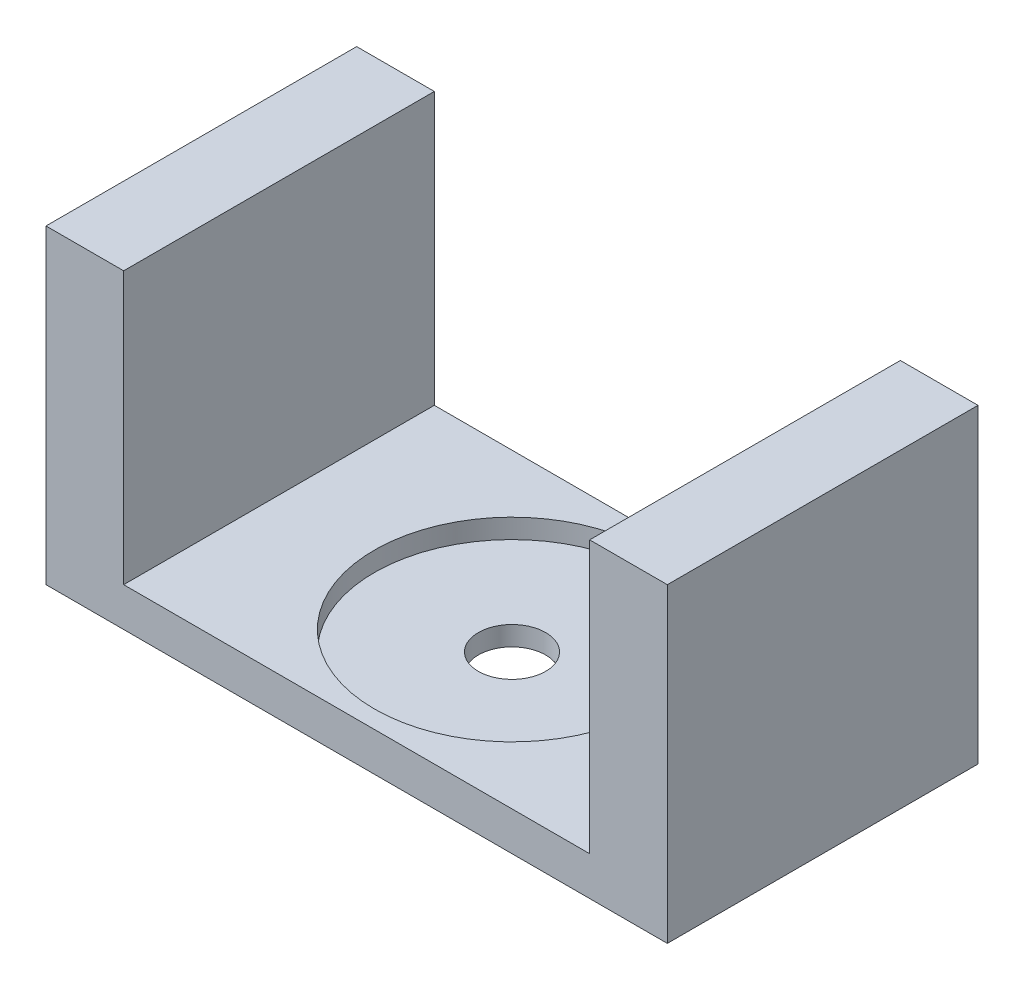
ISO-10303-21;
HEADER;
FILE_DESCRIPTION(('STEP AP214'),'2;1');
FILE_NAME('part.step','',(''),(''),'','','');
FILE_SCHEMA(('AUTOMOTIVE_DESIGN { 1 0 10303 214 1 1 1 1 }'));
ENDSEC;
DATA;
#1=APPLICATION_CONTEXT('core data for automotive mechanical design processes');
#2=APPLICATION_PROTOCOL_DEFINITION('international standard','automotive_design',2000,#1);
#3=PRODUCT_CONTEXT('',#1,'mechanical');
#4=PRODUCT('Part','Part','',(#3));
#5=PRODUCT_RELATED_PRODUCT_CATEGORY('part','',(#4));
#6=PRODUCT_DEFINITION_FORMATION('','',#4);
#7=PRODUCT_DEFINITION_CONTEXT('part definition',#1,'design');
#8=PRODUCT_DEFINITION('design','',#6,#7);
#9=PRODUCT_DEFINITION_SHAPE('','',#8);
#10=(LENGTH_UNIT() NAMED_UNIT(*) SI_UNIT(.MILLI.,.METRE.));
#11=(NAMED_UNIT(*) PLANE_ANGLE_UNIT() SI_UNIT($,.RADIAN.));
#12=(NAMED_UNIT(*) SI_UNIT($,.STERADIAN.) SOLID_ANGLE_UNIT());
#13=UNCERTAINTY_MEASURE_WITH_UNIT(LENGTH_MEASURE(1.E-05),#10,'distance_accuracy_value','');
#14=(GEOMETRIC_REPRESENTATION_CONTEXT(3) GLOBAL_UNCERTAINTY_ASSIGNED_CONTEXT((#13)) GLOBAL_UNIT_ASSIGNED_CONTEXT((#10,
#11,#12)) REPRESENTATION_CONTEXT('',''));
#15=CARTESIAN_POINT('',(0.,0.,0.));
#16=DIRECTION('',(0.,0.,1.));
#17=DIRECTION('',(1.,0.,0.));
#18=AXIS2_PLACEMENT_3D('',#15,#16,#17);
#19=CARTESIAN_POINT('',(-38.1,6.34999999999997,50.8));
#20=DIRECTION('',(-1.,0.,0.));
#21=DIRECTION('',(0.,0.,1.));
#22=AXIS2_PLACEMENT_3D('',#19,#20,#21);
#23=PLANE('',#22);
#24=DIRECTION('',(0.,1.,0.));
#25=VECTOR('',#24,1.);
#26=CARTESIAN_POINT('',(-38.1,6.34999999999997,0.));
#27=LINE('',#26,#25);
#28=CARTESIAN_POINT('',(-38.1,6.34999999999997,0.));
#29=VERTEX_POINT('',#28);
#30=CARTESIAN_POINT('',(-38.1,50.8,0.));
#31=VERTEX_POINT('',#30);
#32=EDGE_CURVE('E128',#29,#31,#27,.T.);
#33=ORIENTED_EDGE('',*,*,#32,.T.);
#34=DIRECTION('',(0.,0.,-1.));
#35=VECTOR('',#34,1.);
#36=CARTESIAN_POINT('',(-38.1,50.8,50.8));
#37=LINE('',#36,#35);
#38=CARTESIAN_POINT('',(-38.1,50.8,50.8));
#39=VERTEX_POINT('',#38);
#40=EDGE_CURVE('E11',#39,#31,#37,.T.);
#41=ORIENTED_EDGE('',*,*,#40,.F.);
#42=DIRECTION('',(0.,1.,0.));
#43=VECTOR('',#42,1.);
#44=CARTESIAN_POINT('',(-38.1,6.34999999999997,50.8));
#45=LINE('',#44,#43);
#46=CARTESIAN_POINT('',(-38.1,6.34999999999997,50.8));
#47=VERTEX_POINT('',#46);
#48=EDGE_CURVE('E143',#47,#39,#45,.T.);
#49=ORIENTED_EDGE('',*,*,#48,.F.);
#50=DIRECTION('',(0.,0.,-1.));
#51=VECTOR('',#50,1.);
#52=CARTESIAN_POINT('',(-38.1,6.34999999999997,50.8));
#53=LINE('',#52,#51);
#54=EDGE_CURVE('E124',#47,#29,#53,.T.);
#55=ORIENTED_EDGE('',*,*,#54,.T.);
#56=EDGE_LOOP('',(#33,#41,#49,#55));
#57=FACE_BOUND('',#56,.T.);
#58=ADVANCED_FACE('F32',(#57),#23,.F.);
#59=CARTESIAN_POINT('',(-38.1,50.8,50.8));
#60=DIRECTION('',(0.,-1.,0.));
#61=DIRECTION('',(1.,0.,0.));
#62=AXIS2_PLACEMENT_3D('',#59,#60,#61);
#63=PLANE('',#62);
#64=DIRECTION('',(-1.,0.,0.));
#65=VECTOR('',#64,1.);
#66=CARTESIAN_POINT('',(-38.1,50.8,0.));
#67=LINE('',#66,#65);
#68=CARTESIAN_POINT('',(-50.8,50.8,0.));
#69=VERTEX_POINT('',#68);
#70=EDGE_CURVE('E131',#31,#69,#67,.T.);
#71=ORIENTED_EDGE('',*,*,#70,.T.);
#72=DIRECTION('',(0.,0.,-1.));
#73=VECTOR('',#72,1.);
#74=CARTESIAN_POINT('',(-50.8,50.8,50.8));
#75=LINE('',#74,#73);
#76=CARTESIAN_POINT('',(-50.8,50.8,50.8));
#77=VERTEX_POINT('',#76);
#78=EDGE_CURVE('E40',#77,#69,#75,.T.);
#79=ORIENTED_EDGE('',*,*,#78,.F.);
#80=DIRECTION('',(-1.,0.,0.));
#81=VECTOR('',#80,1.);
#82=CARTESIAN_POINT('',(-38.1,50.8,50.8));
#83=LINE('',#82,#81);
#84=EDGE_CURVE('E91',#39,#77,#83,.T.);
#85=ORIENTED_EDGE('',*,*,#84,.F.);
#86=ORIENTED_EDGE('',*,*,#40,.T.);
#87=EDGE_LOOP('',(#71,#79,#85,#86));
#88=FACE_BOUND('',#87,.T.);
#89=ADVANCED_FACE('F218',(#88),#63,.F.);
#90=CARTESIAN_POINT('',(-50.8,0.,50.8));
#91=DIRECTION('',(1.,0.,0.));
#92=DIRECTION('',(0.,0.,-1.));
#93=AXIS2_PLACEMENT_3D('',#90,#91,#92);
#94=PLANE('',#93);
#95=DIRECTION('',(0.,-1.,0.));
#96=VECTOR('',#95,1.);
#97=CARTESIAN_POINT('',(-50.8,0.,0.));
#98=LINE('',#97,#96);
#99=CARTESIAN_POINT('',(-50.8,0.,0.));
#100=VERTEX_POINT('',#99);
#101=EDGE_CURVE('E134',#69,#100,#98,.T.);
#102=ORIENTED_EDGE('',*,*,#101,.T.);
#103=DIRECTION('',(0.,0.,-1.));
#104=VECTOR('',#103,1.);
#105=CARTESIAN_POINT('',(-50.8,0.,50.8));
#106=LINE('',#105,#104);
#107=CARTESIAN_POINT('',(-50.8,0.,50.8));
#108=VERTEX_POINT('',#107);
#109=EDGE_CURVE('E150',#108,#100,#106,.T.);
#110=ORIENTED_EDGE('',*,*,#109,.F.);
#111=DIRECTION('',(0.,-1.,0.));
#112=VECTOR('',#111,1.);
#113=CARTESIAN_POINT('',(-50.8,0.,50.8));
#114=LINE('',#113,#112);
#115=EDGE_CURVE('E158',#77,#108,#114,.T.);
#116=ORIENTED_EDGE('',*,*,#115,.F.);
#117=ORIENTED_EDGE('',*,*,#78,.T.);
#118=EDGE_LOOP('',(#102,#110,#116,#117));
#119=FACE_BOUND('',#118,.T.);
#120=ADVANCED_FACE('F156',(#119),#94,.F.);
#121=CARTESIAN_POINT('',(50.8,0.,50.8));
#122=DIRECTION('',(0.,1.,0.));
#123=DIRECTION('',(0.,0.,1.));
#124=AXIS2_PLACEMENT_3D('',#121,#122,#123);
#125=PLANE('',#124);
#126=CARTESIAN_POINT('',(0.,0.,25.4));
#127=DIRECTION('',(0.,1.,0.));
#128=DIRECTION('',(0.,0.,1.));
#129=AXIS2_PLACEMENT_3D('',#126,#127,#128);
#130=CIRCLE('',#129,5.5);
#131=CARTESIAN_POINT('',(0.,0.,30.9));
#132=VERTEX_POINT('',#131);
#133=EDGE_CURVE('E179',#132,#132,#130,.T.);
#134=ORIENTED_EDGE('',*,*,#133,.T.);
#135=EDGE_LOOP('',(#134));
#136=FACE_BOUND('',#135,.T.);
#137=DIRECTION('',(1.,0.,0.));
#138=VECTOR('',#137,1.);
#139=CARTESIAN_POINT('',(50.8,0.,0.));
#140=LINE('',#139,#138);
#141=CARTESIAN_POINT('',(50.8,0.,0.));
#142=VERTEX_POINT('',#141);
#143=EDGE_CURVE('E136',#100,#142,#140,.T.);
#144=ORIENTED_EDGE('',*,*,#143,.T.);
#145=DIRECTION('',(0.,0.,-1.));
#146=VECTOR('',#145,1.);
#147=CARTESIAN_POINT('',(50.8,0.,50.8));
#148=LINE('',#147,#146);
#149=CARTESIAN_POINT('',(50.8,0.,50.8));
#150=VERTEX_POINT('',#149);
#151=EDGE_CURVE('E147',#150,#142,#148,.T.);
#152=ORIENTED_EDGE('',*,*,#151,.F.);
#153=DIRECTION('',(1.,0.,0.));
#154=VECTOR('',#153,1.);
#155=CARTESIAN_POINT('',(50.8,0.,50.8));
#156=LINE('',#155,#154);
#157=EDGE_CURVE('E170',#108,#150,#156,.T.);
#158=ORIENTED_EDGE('',*,*,#157,.F.);
#159=ORIENTED_EDGE('',*,*,#109,.T.);
#160=EDGE_LOOP('',(#144,#152,#158,#159));
#161=FACE_BOUND('',#160,.T.);
#162=ADVANCED_FACE('F166',(#136,#161),#125,.F.);
#163=CARTESIAN_POINT('',(50.8,0.,50.8));
#164=DIRECTION('',(-1.,0.,0.));
#165=DIRECTION('',(0.,0.,1.));
#166=AXIS2_PLACEMENT_3D('',#163,#164,#165);
#167=PLANE('',#166);
#168=DIRECTION('',(0.,1.,0.));
#169=VECTOR('',#168,1.);
#170=CARTESIAN_POINT('',(50.8,0.,0.));
#171=LINE('',#170,#169);
#172=CARTESIAN_POINT('',(50.8,50.8,0.));
#173=VERTEX_POINT('',#172);
#174=EDGE_CURVE('E138',#142,#173,#171,.T.);
#175=ORIENTED_EDGE('',*,*,#174,.T.);
#176=DIRECTION('',(0.,0.,-1.));
#177=VECTOR('',#176,1.);
#178=CARTESIAN_POINT('',(50.8,50.8,50.8));
#179=LINE('',#178,#177);
#180=CARTESIAN_POINT('',(50.8,50.8,50.8));
#181=VERTEX_POINT('',#180);
#182=EDGE_CURVE('E119',#181,#173,#179,.T.);
#183=ORIENTED_EDGE('',*,*,#182,.F.);
#184=DIRECTION('',(0.,1.,0.));
#185=VECTOR('',#184,1.);
#186=CARTESIAN_POINT('',(50.8,0.,50.8));
#187=LINE('',#186,#185);
#188=EDGE_CURVE('E110',#150,#181,#187,.T.);
#189=ORIENTED_EDGE('',*,*,#188,.F.);
#190=ORIENTED_EDGE('',*,*,#151,.T.);
#191=EDGE_LOOP('',(#175,#183,#189,#190));
#192=FACE_BOUND('',#191,.T.);
#193=ADVANCED_FACE('F169',(#192),#167,.F.);
#194=CARTESIAN_POINT('',(38.1,50.8,50.8));
#195=DIRECTION('',(0.,-1.,0.));
#196=DIRECTION('',(1.,0.,0.));
#197=AXIS2_PLACEMENT_3D('',#194,#195,#196);
#198=PLANE('',#197);
#199=DIRECTION('',(-1.,0.,0.));
#200=VECTOR('',#199,1.);
#201=CARTESIAN_POINT('',(38.1,50.8,0.));
#202=LINE('',#201,#200);
#203=CARTESIAN_POINT('',(38.1,50.8,0.));
#204=VERTEX_POINT('',#203);
#205=EDGE_CURVE('E118',#173,#204,#202,.T.);
#206=ORIENTED_EDGE('',*,*,#205,.T.);
#207=DIRECTION('',(0.,0.,-1.));
#208=VECTOR('',#207,1.);
#209=CARTESIAN_POINT('',(38.1,50.8,50.8));
#210=LINE('',#209,#208);
#211=CARTESIAN_POINT('',(38.1,50.8,50.8));
#212=VERTEX_POINT('',#211);
#213=EDGE_CURVE('E115',#212,#204,#210,.T.);
#214=ORIENTED_EDGE('',*,*,#213,.F.);
#215=DIRECTION('',(-1.,0.,0.));
#216=VECTOR('',#215,1.);
#217=CARTESIAN_POINT('',(38.1,50.8,50.8));
#218=LINE('',#217,#216);
#219=EDGE_CURVE('E104',#181,#212,#218,.T.);
#220=ORIENTED_EDGE('',*,*,#219,.F.);
#221=ORIENTED_EDGE('',*,*,#182,.T.);
#222=EDGE_LOOP('',(#206,#214,#220,#221));
#223=FACE_BOUND('',#222,.T.);
#224=ADVANCED_FACE('F116',(#223),#198,.F.);
#225=CARTESIAN_POINT('',(38.1,6.34999999999997,50.8));
#226=DIRECTION('',(1.,0.,0.));
#227=DIRECTION('',(0.,0.,-1.));
#228=AXIS2_PLACEMENT_3D('',#225,#226,#227);
#229=PLANE('',#228);
#230=DIRECTION('',(0.,-1.,0.));
#231=VECTOR('',#230,1.);
#232=CARTESIAN_POINT('',(38.1,6.34999999999997,0.));
#233=LINE('',#232,#231);
#234=CARTESIAN_POINT('',(38.1,6.34999999999997,0.));
#235=VERTEX_POINT('',#234);
#236=EDGE_CURVE('E77',#204,#235,#233,.T.);
#237=ORIENTED_EDGE('',*,*,#236,.T.);
#238=DIRECTION('',(0.,0.,-1.));
#239=VECTOR('',#238,1.);
#240=CARTESIAN_POINT('',(38.1,6.34999999999997,50.8));
#241=LINE('',#240,#239);
#242=CARTESIAN_POINT('',(38.1,6.34999999999997,50.8));
#243=VERTEX_POINT('',#242);
#244=EDGE_CURVE('E120',#243,#235,#241,.T.);
#245=ORIENTED_EDGE('',*,*,#244,.F.);
#246=DIRECTION('',(0.,-1.,0.));
#247=VECTOR('',#246,1.);
#248=CARTESIAN_POINT('',(38.1,6.34999999999997,50.8));
#249=LINE('',#248,#247);
#250=EDGE_CURVE('E108',#212,#243,#249,.T.);
#251=ORIENTED_EDGE('',*,*,#250,.F.);
#252=ORIENTED_EDGE('',*,*,#213,.T.);
#253=EDGE_LOOP('',(#237,#245,#251,#252));
#254=FACE_BOUND('',#253,.T.);
#255=ADVANCED_FACE('F122',(#254),#229,.F.);
#256=CARTESIAN_POINT('',(38.1,6.34999999999997,50.8));
#257=DIRECTION('',(0.,-1.,0.));
#258=DIRECTION('',(0.,0.,-1.));
#259=AXIS2_PLACEMENT_3D('',#256,#257,#258);
#260=PLANE('',#259);
#261=CARTESIAN_POINT('',(0.,6.34999999999997,25.4));
#262=DIRECTION('',(0.,1.,0.));
#263=DIRECTION('',(0.,0.,1.));
#264=AXIS2_PLACEMENT_3D('',#261,#262,#263);
#265=CIRCLE('',#264,22.5044);
#266=CARTESIAN_POINT('',(0.,6.34999999999997,47.9044));
#267=VERTEX_POINT('',#266);
#268=EDGE_CURVE('E176',#267,#267,#265,.T.);
#269=ORIENTED_EDGE('',*,*,#268,.F.);
#270=EDGE_LOOP('',(#269));
#271=FACE_BOUND('',#270,.T.);
#272=DIRECTION('',(-1.,0.,0.));
#273=VECTOR('',#272,1.);
#274=CARTESIAN_POINT('',(38.1,6.34999999999997,0.));
#275=LINE('',#274,#273);
#276=EDGE_CURVE('E83',#235,#29,#275,.T.);
#277=ORIENTED_EDGE('',*,*,#276,.T.);
#278=ORIENTED_EDGE('',*,*,#54,.F.);
#279=DIRECTION('',(-1.,0.,0.));
#280=VECTOR('',#279,1.);
#281=CARTESIAN_POINT('',(38.1,6.34999999999997,50.8));
#282=LINE('',#281,#280);
#283=EDGE_CURVE('E48',#243,#47,#282,.T.);
#284=ORIENTED_EDGE('',*,*,#283,.F.);
#285=ORIENTED_EDGE('',*,*,#244,.T.);
#286=EDGE_LOOP('',(#277,#278,#284,#285));
#287=FACE_BOUND('',#286,.T.);
#288=ADVANCED_FACE('F207',(#271,#287),#260,.F.);
#289=CARTESIAN_POINT('',(0.,0.,50.8));
#290=DIRECTION('',(0.,0.,1.));
#291=DIRECTION('',(1.,0.,0.));
#292=AXIS2_PLACEMENT_3D('',#289,#290,#291);
#293=PLANE('',#292);
#294=ORIENTED_EDGE('',*,*,#48,.T.);
#295=ORIENTED_EDGE('',*,*,#84,.T.);
#296=ORIENTED_EDGE('',*,*,#115,.T.);
#297=ORIENTED_EDGE('',*,*,#157,.T.);
#298=ORIENTED_EDGE('',*,*,#188,.T.);
#299=ORIENTED_EDGE('',*,*,#219,.T.);
#300=ORIENTED_EDGE('',*,*,#250,.T.);
#301=ORIENTED_EDGE('',*,*,#283,.T.);
#302=EDGE_LOOP('',(#294,#295,#296,#297,#298,#299,#300,#301));
#303=FACE_BOUND('',#302,.T.);
#304=ADVANCED_FACE('F106',(#303),#293,.T.);
#305=CARTESIAN_POINT('',(0.,0.,0.));
#306=DIRECTION('',(0.,0.,1.));
#307=DIRECTION('',(1.,0.,0.));
#308=AXIS2_PLACEMENT_3D('',#305,#306,#307);
#309=PLANE('',#308);
#310=ORIENTED_EDGE('',*,*,#32,.F.);
#311=ORIENTED_EDGE('',*,*,#276,.F.);
#312=ORIENTED_EDGE('',*,*,#236,.F.);
#313=ORIENTED_EDGE('',*,*,#205,.F.);
#314=ORIENTED_EDGE('',*,*,#174,.F.);
#315=ORIENTED_EDGE('',*,*,#143,.F.);
#316=ORIENTED_EDGE('',*,*,#101,.F.);
#317=ORIENTED_EDGE('',*,*,#70,.F.);
#318=EDGE_LOOP('',(#310,#311,#312,#313,#314,#315,#316,#317));
#319=FACE_BOUND('',#318,.T.);
#320=ADVANCED_FACE('F162',(#319),#309,.F.);
#321=CARTESIAN_POINT('',(0.,3.17499999999997,25.4));
#322=DIRECTION('',(0.,1.,0.));
#323=DIRECTION('',(0.,0.,1.));
#324=AXIS2_PLACEMENT_3D('',#321,#322,#323);
#325=CYLINDRICAL_SURFACE('',#324,22.5044);
#326=CARTESIAN_POINT('',(0.,3.17499999999997,25.4));
#327=DIRECTION('',(0.,1.,0.));
#328=DIRECTION('',(0.,0.,1.));
#329=AXIS2_PLACEMENT_3D('',#326,#327,#328);
#330=CIRCLE('',#329,22.5044);
#331=CARTESIAN_POINT('',(0.,3.17499999999997,47.9044));
#332=VERTEX_POINT('',#331);
#333=EDGE_CURVE('E132',#332,#332,#330,.T.);
#334=ORIENTED_EDGE('',*,*,#333,.F.);
#335=EDGE_LOOP('',(#334));
#336=FACE_BOUND('',#335,.T.);
#337=ORIENTED_EDGE('',*,*,#268,.T.);
#338=EDGE_LOOP('',(#337));
#339=FACE_BOUND('',#338,.T.);
#340=ADVANCED_FACE('F198',(#336,#339),#325,.F.);
#341=CARTESIAN_POINT('',(0.,3.17499999999997,25.4));
#342=DIRECTION('',(0.,1.,0.));
#343=DIRECTION('',(0.,0.,1.));
#344=AXIS2_PLACEMENT_3D('',#341,#342,#343);
#345=PLANE('',#344);
#346=CARTESIAN_POINT('',(0.,3.17499999999997,25.4));
#347=DIRECTION('',(0.,1.,0.));
#348=DIRECTION('',(0.,0.,1.));
#349=AXIS2_PLACEMENT_3D('',#346,#347,#348);
#350=CIRCLE('',#349,5.5);
#351=CARTESIAN_POINT('',(0.,3.17499999999997,30.9));
#352=VERTEX_POINT('',#351);
#353=EDGE_CURVE('E182',#352,#352,#350,.T.);
#354=ORIENTED_EDGE('',*,*,#353,.F.);
#355=EDGE_LOOP('',(#354));
#356=FACE_BOUND('',#355,.T.);
#357=ORIENTED_EDGE('',*,*,#333,.T.);
#358=EDGE_LOOP('',(#357));
#359=FACE_BOUND('',#358,.T.);
#360=ADVANCED_FACE('F192',(#356,#359),#345,.T.);
#361=CARTESIAN_POINT('',(0.,0.,25.4));
#362=DIRECTION('',(0.,1.,0.));
#363=DIRECTION('',(0.,0.,1.));
#364=AXIS2_PLACEMENT_3D('',#361,#362,#363);
#365=CYLINDRICAL_SURFACE('',#364,5.5);
#366=ORIENTED_EDGE('',*,*,#133,.F.);
#367=EDGE_LOOP('',(#366));
#368=FACE_BOUND('',#367,.T.);
#369=ORIENTED_EDGE('',*,*,#353,.T.);
#370=EDGE_LOOP('',(#369));
#371=FACE_BOUND('',#370,.T.);
#372=ADVANCED_FACE('F189',(#368,#371),#365,.F.);
#373=CLOSED_SHELL('',(#58,#89,#120,#162,#193,#224,#255,#288,#304,#320,#340,#360,#372));
#374=MANIFOLD_SOLID_BREP('B2',#373);
#375=ADVANCED_BREP_SHAPE_REPRESENTATION('',(#18,#374),#14);
#376=SHAPE_DEFINITION_REPRESENTATION(#9,#375);
ENDSEC;
END-ISO-10303-21;
